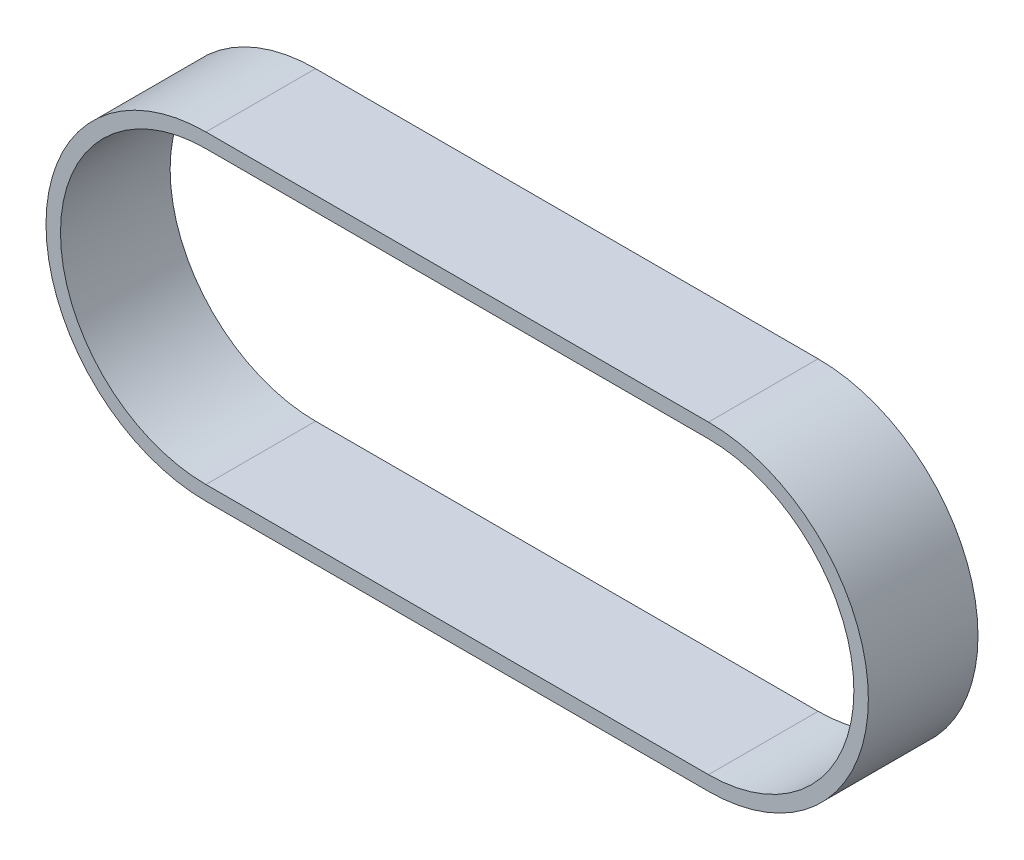
ISO-10303-21;
HEADER;
FILE_DESCRIPTION(('STEP AP214'),'2;1');
FILE_NAME('part.step','',(''),(''),'','','');
FILE_SCHEMA(('AUTOMOTIVE_DESIGN { 1 0 10303 214 1 1 1 1 }'));
ENDSEC;
DATA;
#1=APPLICATION_CONTEXT('core data for automotive mechanical design processes');
#2=APPLICATION_PROTOCOL_DEFINITION('international standard','automotive_design',2000,#1);
#3=PRODUCT_CONTEXT('',#1,'mechanical');
#4=PRODUCT('Part','Part','',(#3));
#5=PRODUCT_RELATED_PRODUCT_CATEGORY('part','',(#4));
#6=PRODUCT_DEFINITION_FORMATION('','',#4);
#7=PRODUCT_DEFINITION_CONTEXT('part definition',#1,'design');
#8=PRODUCT_DEFINITION('design','',#6,#7);
#9=PRODUCT_DEFINITION_SHAPE('','',#8);
#10=(LENGTH_UNIT() NAMED_UNIT(*) SI_UNIT(.MILLI.,.METRE.));
#11=(NAMED_UNIT(*) PLANE_ANGLE_UNIT() SI_UNIT($,.RADIAN.));
#12=(NAMED_UNIT(*) SI_UNIT($,.STERADIAN.) SOLID_ANGLE_UNIT());
#13=UNCERTAINTY_MEASURE_WITH_UNIT(LENGTH_MEASURE(1.E-05),#10,'distance_accuracy_value','');
#14=(GEOMETRIC_REPRESENTATION_CONTEXT(3) GLOBAL_UNCERTAINTY_ASSIGNED_CONTEXT((#13)) GLOBAL_UNIT_ASSIGNED_CONTEXT((#10,
#11,#12)) REPRESENTATION_CONTEXT('',''));
#15=CARTESIAN_POINT('',(0.,0.,0.));
#16=DIRECTION('',(0.,0.,1.));
#17=DIRECTION('',(1.,0.,0.));
#18=AXIS2_PLACEMENT_3D('',#15,#16,#17);
#19=CARTESIAN_POINT('',(0.,0.,12.));
#20=DIRECTION('',(0.,0.,1.));
#21=DIRECTION('',(1.,0.,0.));
#22=AXIS2_PLACEMENT_3D('',#19,#20,#21);
#23=PLANE('',#22);
#24=CARTESIAN_POINT('',(0.,0.,12.));
#25=DIRECTION('',(0.,0.,1.));
#26=DIRECTION('',(1.,0.,0.));
#27=AXIS2_PLACEMENT_3D('',#24,#25,#26);
#28=CIRCLE('',#27,17.5);
#29=CARTESIAN_POINT('',(0.,17.5,12.));
#30=VERTEX_POINT('',#29);
#31=CARTESIAN_POINT('',(0.,-17.5,12.));
#32=VERTEX_POINT('',#31);
#33=EDGE_CURVE('E131',#30,#32,#28,.T.);
#34=ORIENTED_EDGE('',*,*,#33,.T.);
#35=DIRECTION('',(1.,0.,0.));
#36=VECTOR('',#35,1.);
#37=CARTESIAN_POINT('',(0.,-17.5,12.));
#38=LINE('',#37,#36);
#39=CARTESIAN_POINT('',(55.,-17.5,12.));
#40=VERTEX_POINT('',#39);
#41=EDGE_CURVE('E134',#32,#40,#38,.T.);
#42=ORIENTED_EDGE('',*,*,#41,.T.);
#43=CARTESIAN_POINT('',(55.,0.,12.));
#44=DIRECTION('',(0.,0.,1.));
#45=DIRECTION('',(1.,0.,0.));
#46=AXIS2_PLACEMENT_3D('',#43,#44,#45);
#47=CIRCLE('',#46,17.5);
#48=CARTESIAN_POINT('',(55.,17.5,12.));
#49=VERTEX_POINT('',#48);
#50=EDGE_CURVE('E137',#40,#49,#47,.T.);
#51=ORIENTED_EDGE('',*,*,#50,.T.);
#52=DIRECTION('',(-1.,0.,0.));
#53=VECTOR('',#52,1.);
#54=CARTESIAN_POINT('',(0.,17.5,12.));
#55=LINE('',#54,#53);
#56=EDGE_CURVE('E139',#49,#30,#55,.T.);
#57=ORIENTED_EDGE('',*,*,#56,.T.);
#58=EDGE_LOOP('',(#34,#42,#51,#57));
#59=FACE_BOUND('',#58,.T.);
#60=DIRECTION('',(1.,0.,0.));
#61=VECTOR('',#60,1.);
#62=CARTESIAN_POINT('',(0.,-15.915,12.));
#63=LINE('',#62,#61);
#64=CARTESIAN_POINT('',(0.,-15.915,12.));
#65=VERTEX_POINT('',#64);
#66=CARTESIAN_POINT('',(55.,-15.915,12.));
#67=VERTEX_POINT('',#66);
#68=EDGE_CURVE('E103',#65,#67,#63,.T.);
#69=ORIENTED_EDGE('',*,*,#68,.F.);
#70=CARTESIAN_POINT('',(0.,0.,12.));
#71=DIRECTION('',(0.,0.,1.));
#72=DIRECTION('',(1.,0.,0.));
#73=AXIS2_PLACEMENT_3D('',#70,#71,#72);
#74=CIRCLE('',#73,15.915);
#75=CARTESIAN_POINT('',(0.,15.915,12.));
#76=VERTEX_POINT('',#75);
#77=EDGE_CURVE('E95',#76,#65,#74,.T.);
#78=ORIENTED_EDGE('',*,*,#77,.F.);
#79=DIRECTION('',(-1.,0.,0.));
#80=VECTOR('',#79,1.);
#81=CARTESIAN_POINT('',(0.,15.915,12.));
#82=LINE('',#81,#80);
#83=CARTESIAN_POINT('',(55.,15.915,12.));
#84=VERTEX_POINT('',#83);
#85=EDGE_CURVE('E117',#84,#76,#82,.T.);
#86=ORIENTED_EDGE('',*,*,#85,.F.);
#87=CARTESIAN_POINT('',(55.,0.,12.));
#88=DIRECTION('',(0.,0.,1.));
#89=DIRECTION('',(1.,0.,0.));
#90=AXIS2_PLACEMENT_3D('',#87,#88,#89);
#91=CIRCLE('',#90,15.915);
#92=EDGE_CURVE('E115',#67,#84,#91,.T.);
#93=ORIENTED_EDGE('',*,*,#92,.F.);
#94=EDGE_LOOP('',(#69,#78,#86,#93));
#95=FACE_BOUND('',#94,.T.);
#96=ADVANCED_FACE('F30',(#59,#95),#23,.T.);
#97=CARTESIAN_POINT('',(0.,0.,0.));
#98=DIRECTION('',(0.,0.,1.));
#99=DIRECTION('',(1.,0.,0.));
#100=AXIS2_PLACEMENT_3D('',#97,#98,#99);
#101=PLANE('',#100);
#102=CARTESIAN_POINT('',(0.,0.,0.));
#103=DIRECTION('',(0.,0.,1.));
#104=DIRECTION('',(1.,0.,0.));
#105=AXIS2_PLACEMENT_3D('',#102,#103,#104);
#106=CIRCLE('',#105,17.5);
#107=CARTESIAN_POINT('',(0.,17.5,0.));
#108=VERTEX_POINT('',#107);
#109=CARTESIAN_POINT('',(0.,-17.5,0.));
#110=VERTEX_POINT('',#109);
#111=EDGE_CURVE('E111',#108,#110,#106,.T.);
#112=ORIENTED_EDGE('',*,*,#111,.F.);
#113=DIRECTION('',(-1.,0.,0.));
#114=VECTOR('',#113,1.);
#115=CARTESIAN_POINT('',(0.,17.5,0.));
#116=LINE('',#115,#114);
#117=CARTESIAN_POINT('',(55.,17.5,0.));
#118=VERTEX_POINT('',#117);
#119=EDGE_CURVE('E135',#118,#108,#116,.T.);
#120=ORIENTED_EDGE('',*,*,#119,.F.);
#121=CARTESIAN_POINT('',(55.,0.,0.));
#122=DIRECTION('',(0.,0.,1.));
#123=DIRECTION('',(1.,0.,0.));
#124=AXIS2_PLACEMENT_3D('',#121,#122,#123);
#125=CIRCLE('',#124,17.5);
#126=CARTESIAN_POINT('',(55.,-17.5,0.));
#127=VERTEX_POINT('',#126);
#128=EDGE_CURVE('E146',#127,#118,#125,.T.);
#129=ORIENTED_EDGE('',*,*,#128,.F.);
#130=DIRECTION('',(1.,0.,0.));
#131=VECTOR('',#130,1.);
#132=CARTESIAN_POINT('',(0.,-17.5,0.));
#133=LINE('',#132,#131);
#134=EDGE_CURVE('E144',#110,#127,#133,.T.);
#135=ORIENTED_EDGE('',*,*,#134,.F.);
#136=EDGE_LOOP('',(#112,#120,#129,#135));
#137=FACE_BOUND('',#136,.T.);
#138=CARTESIAN_POINT('',(0.,0.,0.));
#139=DIRECTION('',(0.,0.,1.));
#140=DIRECTION('',(1.,0.,0.));
#141=AXIS2_PLACEMENT_3D('',#138,#139,#140);
#142=CIRCLE('',#141,15.915);
#143=CARTESIAN_POINT('',(0.,15.915,0.));
#144=VERTEX_POINT('',#143);
#145=CARTESIAN_POINT('',(0.,-15.915,0.));
#146=VERTEX_POINT('',#145);
#147=EDGE_CURVE('E53',#144,#146,#142,.T.);
#148=ORIENTED_EDGE('',*,*,#147,.T.);
#149=DIRECTION('',(1.,0.,0.));
#150=VECTOR('',#149,1.);
#151=CARTESIAN_POINT('',(0.,-15.915,0.));
#152=LINE('',#151,#150);
#153=CARTESIAN_POINT('',(55.,-15.915,0.));
#154=VERTEX_POINT('',#153);
#155=EDGE_CURVE('E110',#146,#154,#152,.T.);
#156=ORIENTED_EDGE('',*,*,#155,.T.);
#157=CARTESIAN_POINT('',(55.,0.,0.));
#158=DIRECTION('',(0.,0.,1.));
#159=DIRECTION('',(1.,0.,0.));
#160=AXIS2_PLACEMENT_3D('',#157,#158,#159);
#161=CIRCLE('',#160,15.915);
#162=CARTESIAN_POINT('',(55.,15.915,0.));
#163=VERTEX_POINT('',#162);
#164=EDGE_CURVE('E123',#154,#163,#161,.T.);
#165=ORIENTED_EDGE('',*,*,#164,.T.);
#166=DIRECTION('',(-1.,0.,0.));
#167=VECTOR('',#166,1.);
#168=CARTESIAN_POINT('',(0.,15.915,0.));
#169=LINE('',#168,#167);
#170=EDGE_CURVE('E104',#163,#144,#169,.T.);
#171=ORIENTED_EDGE('',*,*,#170,.T.);
#172=EDGE_LOOP('',(#148,#156,#165,#171));
#173=FACE_BOUND('',#172,.T.);
#174=ADVANCED_FACE('F164',(#137,#173),#101,.F.);
#175=CARTESIAN_POINT('',(0.,0.,12.));
#176=DIRECTION('',(0.,0.,-1.));
#177=DIRECTION('',(-1.,0.,0.));
#178=AXIS2_PLACEMENT_3D('',#175,#176,#177);
#179=CYLINDRICAL_SURFACE('',#178,17.5);
#180=ORIENTED_EDGE('',*,*,#111,.T.);
#181=DIRECTION('',(0.,0.,-1.));
#182=VECTOR('',#181,1.);
#183=CARTESIAN_POINT('',(0.,-17.5,12.));
#184=LINE('',#183,#182);
#185=EDGE_CURVE('E11',#32,#110,#184,.T.);
#186=ORIENTED_EDGE('',*,*,#185,.F.);
#187=ORIENTED_EDGE('',*,*,#33,.F.);
#188=DIRECTION('',(0.,0.,-1.));
#189=VECTOR('',#188,1.);
#190=CARTESIAN_POINT('',(0.,17.5,12.));
#191=LINE('',#190,#189);
#192=EDGE_CURVE('E141',#30,#108,#191,.T.);
#193=ORIENTED_EDGE('',*,*,#192,.T.);
#194=EDGE_LOOP('',(#180,#186,#187,#193));
#195=FACE_BOUND('',#194,.T.);
#196=ADVANCED_FACE('F32',(#195),#179,.T.);
#197=CARTESIAN_POINT('',(0.,-17.5,12.));
#198=DIRECTION('',(0.,1.,0.));
#199=DIRECTION('',(-1.,0.,0.));
#200=AXIS2_PLACEMENT_3D('',#197,#198,#199);
#201=PLANE('',#200);
#202=ORIENTED_EDGE('',*,*,#134,.T.);
#203=DIRECTION('',(0.,0.,-1.));
#204=VECTOR('',#203,1.);
#205=CARTESIAN_POINT('',(55.,-17.5,12.));
#206=LINE('',#205,#204);
#207=EDGE_CURVE('E38',#40,#127,#206,.T.);
#208=ORIENTED_EDGE('',*,*,#207,.F.);
#209=ORIENTED_EDGE('',*,*,#41,.F.);
#210=ORIENTED_EDGE('',*,*,#185,.T.);
#211=EDGE_LOOP('',(#202,#208,#209,#210));
#212=FACE_BOUND('',#211,.T.);
#213=ADVANCED_FACE('F174',(#212),#201,.F.);
#214=CARTESIAN_POINT('',(55.,0.,12.));
#215=DIRECTION('',(0.,0.,-1.));
#216=DIRECTION('',(-1.,0.,0.));
#217=AXIS2_PLACEMENT_3D('',#214,#215,#216);
#218=CYLINDRICAL_SURFACE('',#217,17.5);
#219=ORIENTED_EDGE('',*,*,#128,.T.);
#220=DIRECTION('',(0.,0.,-1.));
#221=VECTOR('',#220,1.);
#222=CARTESIAN_POINT('',(55.,17.5,12.));
#223=LINE('',#222,#221);
#224=EDGE_CURVE('E151',#49,#118,#223,.T.);
#225=ORIENTED_EDGE('',*,*,#224,.F.);
#226=ORIENTED_EDGE('',*,*,#50,.F.);
#227=ORIENTED_EDGE('',*,*,#207,.T.);
#228=EDGE_LOOP('',(#219,#225,#226,#227));
#229=FACE_BOUND('',#228,.T.);
#230=ADVANCED_FACE('F158',(#229),#218,.T.);
#231=CARTESIAN_POINT('',(0.,17.5,12.));
#232=DIRECTION('',(0.,-1.,0.));
#233=DIRECTION('',(1.,0.,0.));
#234=AXIS2_PLACEMENT_3D('',#231,#232,#233);
#235=PLANE('',#234);
#236=ORIENTED_EDGE('',*,*,#119,.T.);
#237=ORIENTED_EDGE('',*,*,#192,.F.);
#238=ORIENTED_EDGE('',*,*,#56,.F.);
#239=ORIENTED_EDGE('',*,*,#224,.T.);
#240=EDGE_LOOP('',(#236,#237,#238,#239));
#241=FACE_BOUND('',#240,.T.);
#242=ADVANCED_FACE('F168',(#241),#235,.F.);
#243=CARTESIAN_POINT('',(0.,0.,12.));
#244=DIRECTION('',(0.,0.,-1.));
#245=DIRECTION('',(-1.,0.,0.));
#246=AXIS2_PLACEMENT_3D('',#243,#244,#245);
#247=CYLINDRICAL_SURFACE('',#246,15.915);
#248=ORIENTED_EDGE('',*,*,#147,.F.);
#249=DIRECTION('',(0.,0.,-1.));
#250=VECTOR('',#249,1.);
#251=CARTESIAN_POINT('',(0.,15.915,12.));
#252=LINE('',#251,#250);
#253=EDGE_CURVE('E99',#76,#144,#252,.T.);
#254=ORIENTED_EDGE('',*,*,#253,.F.);
#255=ORIENTED_EDGE('',*,*,#77,.T.);
#256=DIRECTION('',(0.,0.,-1.));
#257=VECTOR('',#256,1.);
#258=CARTESIAN_POINT('',(0.,-15.915,12.));
#259=LINE('',#258,#257);
#260=EDGE_CURVE('E98',#65,#146,#259,.T.);
#261=ORIENTED_EDGE('',*,*,#260,.T.);
#262=EDGE_LOOP('',(#248,#254,#255,#261));
#263=FACE_BOUND('',#262,.T.);
#264=ADVANCED_FACE('F97',(#263),#247,.F.);
#265=CARTESIAN_POINT('',(0.,-15.915,12.));
#266=DIRECTION('',(0.,1.,0.));
#267=DIRECTION('',(0.,0.,1.));
#268=AXIS2_PLACEMENT_3D('',#265,#266,#267);
#269=PLANE('',#268);
#270=ORIENTED_EDGE('',*,*,#155,.F.);
#271=ORIENTED_EDGE('',*,*,#260,.F.);
#272=ORIENTED_EDGE('',*,*,#68,.T.);
#273=DIRECTION('',(0.,0.,-1.));
#274=VECTOR('',#273,1.);
#275=CARTESIAN_POINT('',(55.,-15.915,12.));
#276=LINE('',#275,#274);
#277=EDGE_CURVE('E112',#67,#154,#276,.T.);
#278=ORIENTED_EDGE('',*,*,#277,.T.);
#279=EDGE_LOOP('',(#270,#271,#272,#278));
#280=FACE_BOUND('',#279,.T.);
#281=ADVANCED_FACE('F107',(#280),#269,.T.);
#282=CARTESIAN_POINT('',(55.,0.,12.));
#283=DIRECTION('',(0.,0.,-1.));
#284=DIRECTION('',(-1.,0.,0.));
#285=AXIS2_PLACEMENT_3D('',#282,#283,#284);
#286=CYLINDRICAL_SURFACE('',#285,15.915);
#287=ORIENTED_EDGE('',*,*,#164,.F.);
#288=ORIENTED_EDGE('',*,*,#277,.F.);
#289=ORIENTED_EDGE('',*,*,#92,.T.);
#290=DIRECTION('',(0.,0.,-1.));
#291=VECTOR('',#290,1.);
#292=CARTESIAN_POINT('',(55.,15.915,12.));
#293=LINE('',#292,#291);
#294=EDGE_CURVE('E45',#84,#163,#293,.T.);
#295=ORIENTED_EDGE('',*,*,#294,.T.);
#296=EDGE_LOOP('',(#287,#288,#289,#295));
#297=FACE_BOUND('',#296,.T.);
#298=ADVANCED_FACE('F197',(#297),#286,.F.);
#299=CARTESIAN_POINT('',(0.,15.915,12.));
#300=DIRECTION('',(0.,-1.,0.));
#301=DIRECTION('',(0.,0.,-1.));
#302=AXIS2_PLACEMENT_3D('',#299,#300,#301);
#303=PLANE('',#302);
#304=ORIENTED_EDGE('',*,*,#170,.F.);
#305=ORIENTED_EDGE('',*,*,#294,.F.);
#306=ORIENTED_EDGE('',*,*,#85,.T.);
#307=ORIENTED_EDGE('',*,*,#253,.T.);
#308=EDGE_LOOP('',(#304,#305,#306,#307));
#309=FACE_BOUND('',#308,.T.);
#310=ADVANCED_FACE('F201',(#309),#303,.T.);
#311=CLOSED_SHELL('',(#96,#174,#196,#213,#230,#242,#264,#281,#298,#310));
#312=MANIFOLD_SOLID_BREP('B2',#311);
#313=ADVANCED_BREP_SHAPE_REPRESENTATION('',(#18,#312),#14);
#314=SHAPE_DEFINITION_REPRESENTATION(#9,#313);
ENDSEC;
END-ISO-10303-21;
